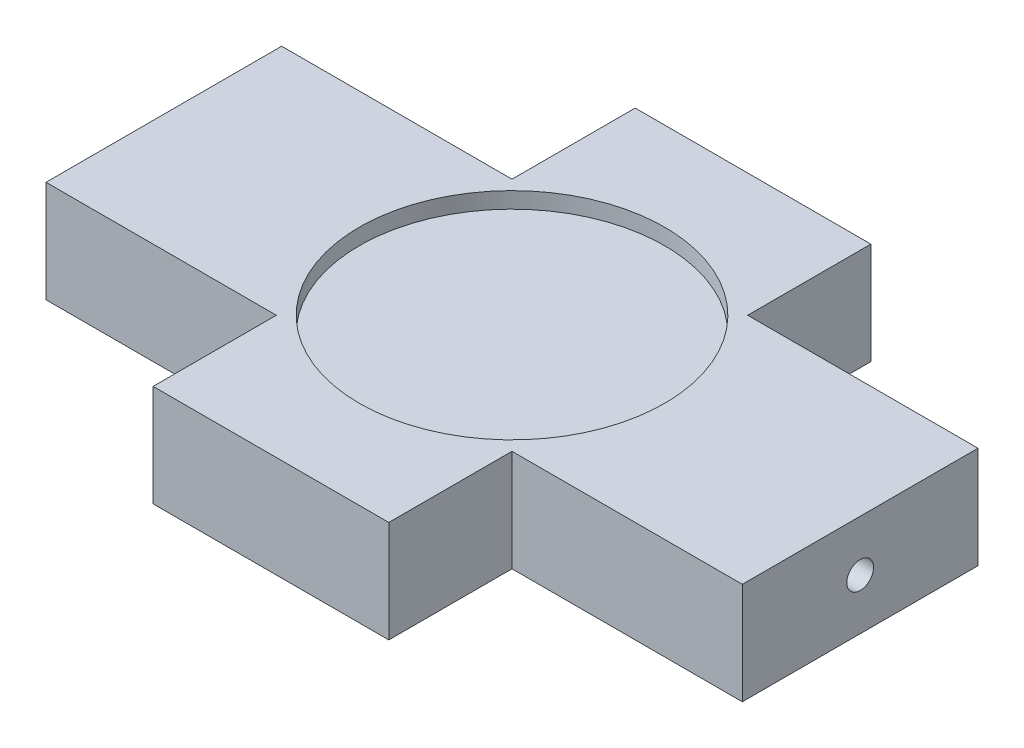
ISO-10303-21;
HEADER;
FILE_DESCRIPTION(('STEP AP214'),'2;1');
FILE_NAME('part.step','',(''),(''),'','','');
FILE_SCHEMA(('AUTOMOTIVE_DESIGN { 1 0 10303 214 1 1 1 1 }'));
ENDSEC;
DATA;
#1=APPLICATION_CONTEXT('core data for automotive mechanical design processes');
#2=APPLICATION_PROTOCOL_DEFINITION('international standard','automotive_design',2000,#1);
#3=PRODUCT_CONTEXT('',#1,'mechanical');
#4=PRODUCT('Part','Part','',(#3));
#5=PRODUCT_RELATED_PRODUCT_CATEGORY('part','',(#4));
#6=PRODUCT_DEFINITION_FORMATION('','',#4);
#7=PRODUCT_DEFINITION_CONTEXT('part definition',#1,'design');
#8=PRODUCT_DEFINITION('design','',#6,#7);
#9=PRODUCT_DEFINITION_SHAPE('','',#8);
#10=(LENGTH_UNIT() NAMED_UNIT(*) SI_UNIT(.MILLI.,.METRE.));
#11=(NAMED_UNIT(*) PLANE_ANGLE_UNIT() SI_UNIT($,.RADIAN.));
#12=(NAMED_UNIT(*) SI_UNIT($,.STERADIAN.) SOLID_ANGLE_UNIT());
#13=UNCERTAINTY_MEASURE_WITH_UNIT(LENGTH_MEASURE(1.E-05),#10,'distance_accuracy_value','');
#14=(GEOMETRIC_REPRESENTATION_CONTEXT(3) GLOBAL_UNCERTAINTY_ASSIGNED_CONTEXT((#13)) GLOBAL_UNIT_ASSIGNED_CONTEXT((#10,
#11,#12)) REPRESENTATION_CONTEXT('',''));
#15=CARTESIAN_POINT('',(0.,0.,0.));
#16=DIRECTION('',(0.,0.,1.));
#17=DIRECTION('',(1.,0.,0.));
#18=AXIS2_PLACEMENT_3D('',#15,#16,#17);
#19=CARTESIAN_POINT('',(0.,19.,0.));
#20=DIRECTION('',(0.,0.,-1.));
#21=DIRECTION('',(-1.,0.,0.));
#22=AXIS2_PLACEMENT_3D('',#19,#20,#21);
#23=PLANE('',#22);
#24=DIRECTION('',(1.,0.,0.));
#25=VECTOR('',#24,1.);
#26=CARTESIAN_POINT('',(0.,0.,0.));
#27=LINE('',#26,#25);
#28=CARTESIAN_POINT('',(23.,0.,0.));
#29=VERTEX_POINT('',#28);
#30=CARTESIAN_POINT('',(67.,0.,0.));
#31=VERTEX_POINT('',#30);
#32=EDGE_CURVE('E221',#29,#31,#27,.T.);
#33=ORIENTED_EDGE('',*,*,#32,.T.);
#34=DIRECTION('',(0.,1.,0.));
#35=VECTOR('',#34,1.);
#36=CARTESIAN_POINT('',(67.,0.,0.));
#37=LINE('',#36,#35);
#38=CARTESIAN_POINT('',(67.,19.,0.));
#39=VERTEX_POINT('',#38);
#40=EDGE_CURVE('E171',#31,#39,#37,.T.);
#41=ORIENTED_EDGE('',*,*,#40,.T.);
#42=DIRECTION('',(1.,0.,0.));
#43=VECTOR('',#42,1.);
#44=CARTESIAN_POINT('',(0.,19.,0.));
#45=LINE('',#44,#43);
#46=CARTESIAN_POINT('',(23.,19.,0.));
#47=VERTEX_POINT('',#46);
#48=EDGE_CURVE('E45',#47,#39,#45,.T.);
#49=ORIENTED_EDGE('',*,*,#48,.F.);
#50=DIRECTION('',(0.,1.,0.));
#51=VECTOR('',#50,1.);
#52=CARTESIAN_POINT('',(23.,0.,0.));
#53=LINE('',#52,#51);
#54=EDGE_CURVE('E187',#29,#47,#53,.T.);
#55=ORIENTED_EDGE('',*,*,#54,.F.);
#56=EDGE_LOOP('',(#33,#41,#49,#55));
#57=FACE_BOUND('',#56,.T.);
#58=ADVANCED_FACE('F36',(#57),#23,.F.);
#59=CARTESIAN_POINT('',(0.,19.,-90.));
#60=DIRECTION('',(0.,0.,1.));
#61=DIRECTION('',(1.,0.,0.));
#62=AXIS2_PLACEMENT_3D('',#59,#60,#61);
#63=PLANE('',#62);
#64=DIRECTION('',(-1.,0.,0.));
#65=VECTOR('',#64,1.);
#66=CARTESIAN_POINT('',(0.,19.,-90.));
#67=LINE('',#66,#65);
#68=CARTESIAN_POINT('',(67.,19.,-90.));
#69=VERTEX_POINT('',#68);
#70=CARTESIAN_POINT('',(23.,19.,-90.));
#71=VERTEX_POINT('',#70);
#72=EDGE_CURVE('E11',#69,#71,#67,.T.);
#73=ORIENTED_EDGE('',*,*,#72,.F.);
#74=DIRECTION('',(0.,1.,0.));
#75=VECTOR('',#74,1.);
#76=CARTESIAN_POINT('',(67.,0.,-90.));
#77=LINE('',#76,#75);
#78=CARTESIAN_POINT('',(67.,0.,-90.));
#79=VERTEX_POINT('',#78);
#80=EDGE_CURVE('E167',#79,#69,#77,.T.);
#81=ORIENTED_EDGE('',*,*,#80,.F.);
#82=DIRECTION('',(-1.,0.,0.));
#83=VECTOR('',#82,1.);
#84=CARTESIAN_POINT('',(0.,0.,-90.));
#85=LINE('',#84,#83);
#86=CARTESIAN_POINT('',(23.,0.,-90.));
#87=VERTEX_POINT('',#86);
#88=EDGE_CURVE('E39',#79,#87,#85,.T.);
#89=ORIENTED_EDGE('',*,*,#88,.T.);
#90=DIRECTION('',(0.,1.,0.));
#91=VECTOR('',#90,1.);
#92=CARTESIAN_POINT('',(23.,0.,-90.));
#93=LINE('',#92,#91);
#94=EDGE_CURVE('E150',#87,#71,#93,.T.);
#95=ORIENTED_EDGE('',*,*,#94,.T.);
#96=EDGE_LOOP('',(#73,#81,#89,#95));
#97=FACE_BOUND('',#96,.T.);
#98=ADVANCED_FACE('F230',(#97),#63,.F.);
#99=CARTESIAN_POINT('',(0.,19.,0.));
#100=DIRECTION('',(0.,-1.,0.));
#101=DIRECTION('',(0.,0.,-1.));
#102=AXIS2_PLACEMENT_3D('',#99,#100,#101);
#103=PLANE('',#102);
#104=CARTESIAN_POINT('',(45.,19.,-45.));
#105=DIRECTION('',(0.,1.,0.));
#106=DIRECTION('',(0.,0.,1.));
#107=AXIS2_PLACEMENT_3D('',#104,#105,#106);
#108=CIRCLE('',#107,28.5);
#109=CARTESIAN_POINT('',(45.,19.,-16.5));
#110=VERTEX_POINT('',#109);
#111=EDGE_CURVE('E193',#110,#110,#108,.T.);
#112=ORIENTED_EDGE('',*,*,#111,.F.);
#113=EDGE_LOOP('',(#112));
#114=FACE_BOUND('',#113,.T.);
#115=ORIENTED_EDGE('',*,*,#48,.T.);
#116=DIRECTION('',(0.,0.,1.));
#117=VECTOR('',#116,1.);
#118=CARTESIAN_POINT('',(67.,19.,0.));
#119=LINE('',#118,#117);
#120=CARTESIAN_POINT('',(67.,19.,-23.));
#121=VERTEX_POINT('',#120);
#122=EDGE_CURVE('E178',#121,#39,#119,.T.);
#123=ORIENTED_EDGE('',*,*,#122,.F.);
#124=DIRECTION('',(-1.,0.,0.));
#125=VECTOR('',#124,1.);
#126=CARTESIAN_POINT('',(110.,19.,-23.));
#127=LINE('',#126,#125);
#128=CARTESIAN_POINT('',(110.,19.,-23.));
#129=VERTEX_POINT('',#128);
#130=EDGE_CURVE('E217',#129,#121,#127,.T.);
#131=ORIENTED_EDGE('',*,*,#130,.F.);
#132=DIRECTION('',(0.,0.,1.));
#133=VECTOR('',#132,1.);
#134=CARTESIAN_POINT('',(110.,19.,-23.));
#135=LINE('',#134,#133);
#136=CARTESIAN_POINT('',(110.,19.,-67.));
#137=VERTEX_POINT('',#136);
#138=EDGE_CURVE('E87',#137,#129,#135,.T.);
#139=ORIENTED_EDGE('',*,*,#138,.F.);
#140=DIRECTION('',(-1.,0.,0.));
#141=VECTOR('',#140,1.);
#142=CARTESIAN_POINT('',(110.,19.,-67.));
#143=LINE('',#142,#141);
#144=CARTESIAN_POINT('',(67.,19.,-67.));
#145=VERTEX_POINT('',#144);
#146=EDGE_CURVE('E219',#137,#145,#143,.T.);
#147=ORIENTED_EDGE('',*,*,#146,.T.);
#148=DIRECTION('',(0.,0.,1.));
#149=VECTOR('',#148,1.);
#150=CARTESIAN_POINT('',(67.,19.,-90.));
#151=LINE('',#150,#149);
#152=EDGE_CURVE('E168',#69,#145,#151,.T.);
#153=ORIENTED_EDGE('',*,*,#152,.F.);
#154=ORIENTED_EDGE('',*,*,#72,.T.);
#155=DIRECTION('',(0.,0.,-1.));
#156=VECTOR('',#155,1.);
#157=CARTESIAN_POINT('',(23.,19.,-90.));
#158=LINE('',#157,#156);
#159=CARTESIAN_POINT('',(23.,19.,-67.));
#160=VERTEX_POINT('',#159);
#161=EDGE_CURVE('E154',#160,#71,#158,.T.);
#162=ORIENTED_EDGE('',*,*,#161,.F.);
#163=CARTESIAN_POINT('',(-20.,19.,-67.));
#164=VERTEX_POINT('',#163);
#165=EDGE_CURVE('E147',#160,#164,#143,.T.);
#166=ORIENTED_EDGE('',*,*,#165,.T.);
#167=DIRECTION('',(0.,0.,1.));
#168=VECTOR('',#167,1.);
#169=CARTESIAN_POINT('',(-20.,19.,-23.));
#170=LINE('',#169,#168);
#171=CARTESIAN_POINT('',(-20.,19.,-23.));
#172=VERTEX_POINT('',#171);
#173=EDGE_CURVE('E208',#164,#172,#170,.T.);
#174=ORIENTED_EDGE('',*,*,#173,.T.);
#175=CARTESIAN_POINT('',(23.,19.,-23.));
#176=VERTEX_POINT('',#175);
#177=EDGE_CURVE('E216',#176,#172,#127,.T.);
#178=ORIENTED_EDGE('',*,*,#177,.F.);
#179=DIRECTION('',(0.,0.,-1.));
#180=VECTOR('',#179,1.);
#181=CARTESIAN_POINT('',(23.,19.,0.));
#182=LINE('',#181,#180);
#183=EDGE_CURVE('E162',#47,#176,#182,.T.);
#184=ORIENTED_EDGE('',*,*,#183,.F.);
#185=EDGE_LOOP('',(#115,#123,#131,#139,#147,#153,#154,#162,#166,#174,#178,#184));
#186=FACE_BOUND('',#185,.T.);
#187=ADVANCED_FACE('F243',(#114,#186),#103,.F.);
#188=CARTESIAN_POINT('',(0.,0.,0.));
#189=DIRECTION('',(0.,-1.,0.));
#190=DIRECTION('',(0.,0.,-1.));
#191=AXIS2_PLACEMENT_3D('',#188,#189,#190);
#192=PLANE('',#191);
#193=DIRECTION('',(0.,0.,1.));
#194=VECTOR('',#193,1.);
#195=CARTESIAN_POINT('',(67.,0.,0.));
#196=LINE('',#195,#194);
#197=CARTESIAN_POINT('',(67.,0.,-23.));
#198=VERTEX_POINT('',#197);
#199=EDGE_CURVE('E175',#198,#31,#196,.T.);
#200=ORIENTED_EDGE('',*,*,#199,.T.);
#201=ORIENTED_EDGE('',*,*,#32,.F.);
#202=DIRECTION('',(0.,0.,-1.));
#203=VECTOR('',#202,1.);
#204=CARTESIAN_POINT('',(23.,0.,0.));
#205=LINE('',#204,#203);
#206=CARTESIAN_POINT('',(23.,0.,-23.));
#207=VERTEX_POINT('',#206);
#208=EDGE_CURVE('E185',#29,#207,#205,.T.);
#209=ORIENTED_EDGE('',*,*,#208,.T.);
#210=DIRECTION('',(-1.,0.,0.));
#211=VECTOR('',#210,1.);
#212=CARTESIAN_POINT('',(110.,0.,-23.));
#213=LINE('',#212,#211);
#214=CARTESIAN_POINT('',(-20.,0.,-23.));
#215=VERTEX_POINT('',#214);
#216=EDGE_CURVE('E72',#207,#215,#213,.T.);
#217=ORIENTED_EDGE('',*,*,#216,.T.);
#218=DIRECTION('',(0.,0.,-1.));
#219=VECTOR('',#218,1.);
#220=CARTESIAN_POINT('',(-20.,0.,-23.));
#221=LINE('',#220,#219);
#222=CARTESIAN_POINT('',(-20.,0.,-67.));
#223=VERTEX_POINT('',#222);
#224=EDGE_CURVE('E140',#215,#223,#221,.T.);
#225=ORIENTED_EDGE('',*,*,#224,.T.);
#226=DIRECTION('',(-1.,0.,0.));
#227=VECTOR('',#226,1.);
#228=CARTESIAN_POINT('',(110.,0.,-67.));
#229=LINE('',#228,#227);
#230=CARTESIAN_POINT('',(23.,0.,-67.));
#231=VERTEX_POINT('',#230);
#232=EDGE_CURVE('E80',#231,#223,#229,.T.);
#233=ORIENTED_EDGE('',*,*,#232,.F.);
#234=DIRECTION('',(0.,0.,-1.));
#235=VECTOR('',#234,1.);
#236=CARTESIAN_POINT('',(23.,0.,-90.));
#237=LINE('',#236,#235);
#238=EDGE_CURVE('E137',#231,#87,#237,.T.);
#239=ORIENTED_EDGE('',*,*,#238,.T.);
#240=ORIENTED_EDGE('',*,*,#88,.F.);
#241=DIRECTION('',(0.,0.,1.));
#242=VECTOR('',#241,1.);
#243=CARTESIAN_POINT('',(67.,0.,-90.));
#244=LINE('',#243,#242);
#245=CARTESIAN_POINT('',(67.,0.,-67.));
#246=VERTEX_POINT('',#245);
#247=EDGE_CURVE('E164',#79,#246,#244,.T.);
#248=ORIENTED_EDGE('',*,*,#247,.T.);
#249=CARTESIAN_POINT('',(110.,0.,-67.));
#250=VERTEX_POINT('',#249);
#251=EDGE_CURVE('E142',#250,#246,#229,.T.);
#252=ORIENTED_EDGE('',*,*,#251,.F.);
#253=DIRECTION('',(0.,0.,-1.));
#254=VECTOR('',#253,1.);
#255=CARTESIAN_POINT('',(110.,0.,-23.));
#256=LINE('',#255,#254);
#257=CARTESIAN_POINT('',(110.,0.,-23.));
#258=VERTEX_POINT('',#257);
#259=EDGE_CURVE('E54',#258,#250,#256,.T.);
#260=ORIENTED_EDGE('',*,*,#259,.F.);
#261=EDGE_CURVE('E214',#258,#198,#213,.T.);
#262=ORIENTED_EDGE('',*,*,#261,.T.);
#263=EDGE_LOOP('',(#200,#201,#209,#217,#225,#233,#239,#240,#248,#252,#260,#262));
#264=FACE_BOUND('',#263,.T.);
#265=ADVANCED_FACE('F134',(#264),#192,.T.);
#266=CARTESIAN_POINT('',(110.,0.,0.));
#267=DIRECTION('',(1.,0.,0.));
#268=DIRECTION('',(0.,0.,-1.));
#269=AXIS2_PLACEMENT_3D('',#266,#267,#268);
#270=PLANE('',#269);
#271=CARTESIAN_POINT('',(110.,9.5,-45.));
#272=DIRECTION('',(1.,0.,0.));
#273=DIRECTION('',(0.,0.,-1.));
#274=AXIS2_PLACEMENT_3D('',#271,#272,#273);
#275=CIRCLE('',#274,2.5);
#276=CARTESIAN_POINT('',(110.,9.5,-47.5));
#277=VERTEX_POINT('',#276);
#278=EDGE_CURVE('E159',#277,#277,#275,.T.);
#279=ORIENTED_EDGE('',*,*,#278,.F.);
#280=EDGE_LOOP('',(#279));
#281=FACE_BOUND('',#280,.T.);
#282=DIRECTION('',(0.,1.,0.));
#283=VECTOR('',#282,1.);
#284=CARTESIAN_POINT('',(110.,19.,-67.));
#285=LINE('',#284,#283);
#286=EDGE_CURVE('E201',#250,#137,#285,.T.);
#287=ORIENTED_EDGE('',*,*,#286,.T.);
#288=ORIENTED_EDGE('',*,*,#138,.T.);
#289=DIRECTION('',(0.,-1.,0.));
#290=VECTOR('',#289,1.);
#291=CARTESIAN_POINT('',(110.,19.,-23.));
#292=LINE('',#291,#290);
#293=EDGE_CURVE('E204',#129,#258,#292,.T.);
#294=ORIENTED_EDGE('',*,*,#293,.T.);
#295=ORIENTED_EDGE('',*,*,#259,.T.);
#296=EDGE_LOOP('',(#287,#288,#294,#295));
#297=FACE_BOUND('',#296,.T.);
#298=ADVANCED_FACE('F239',(#281,#297),#270,.T.);
#299=CARTESIAN_POINT('',(110.,19.,-23.));
#300=DIRECTION('',(0.,0.,-1.));
#301=DIRECTION('',(0.,1.,0.));
#302=AXIS2_PLACEMENT_3D('',#299,#300,#301);
#303=PLANE('',#302);
#304=ORIENTED_EDGE('',*,*,#130,.T.);
#305=DIRECTION('',(0.,1.,0.));
#306=VECTOR('',#305,1.);
#307=CARTESIAN_POINT('',(67.,0.,-23.));
#308=LINE('',#307,#306);
#309=EDGE_CURVE('E177',#198,#121,#308,.T.);
#310=ORIENTED_EDGE('',*,*,#309,.F.);
#311=ORIENTED_EDGE('',*,*,#261,.F.);
#312=ORIENTED_EDGE('',*,*,#293,.F.);
#313=EDGE_LOOP('',(#304,#310,#311,#312));
#314=FACE_BOUND('',#313,.T.);
#315=ADVANCED_FACE('F246',(#314),#303,.F.);
#316=CARTESIAN_POINT('',(110.,19.,-67.));
#317=DIRECTION('',(0.,0.,1.));
#318=DIRECTION('',(1.,0.,0.));
#319=AXIS2_PLACEMENT_3D('',#316,#317,#318);
#320=PLANE('',#319);
#321=ORIENTED_EDGE('',*,*,#251,.T.);
#322=DIRECTION('',(0.,1.,0.));
#323=VECTOR('',#322,1.);
#324=CARTESIAN_POINT('',(67.,0.,-67.));
#325=LINE('',#324,#323);
#326=EDGE_CURVE('E156',#246,#145,#325,.T.);
#327=ORIENTED_EDGE('',*,*,#326,.T.);
#328=ORIENTED_EDGE('',*,*,#146,.F.);
#329=ORIENTED_EDGE('',*,*,#286,.F.);
#330=EDGE_LOOP('',(#321,#327,#328,#329));
#331=FACE_BOUND('',#330,.T.);
#332=ADVANCED_FACE('F238',(#331),#320,.F.);
#333=ORIENTED_EDGE('',*,*,#165,.F.);
#334=DIRECTION('',(0.,1.,0.));
#335=VECTOR('',#334,1.);
#336=CARTESIAN_POINT('',(23.,0.,-67.));
#337=LINE('',#336,#335);
#338=EDGE_CURVE('E145',#231,#160,#337,.T.);
#339=ORIENTED_EDGE('',*,*,#338,.F.);
#340=ORIENTED_EDGE('',*,*,#232,.T.);
#341=DIRECTION('',(0.,1.,0.));
#342=VECTOR('',#341,1.);
#343=CARTESIAN_POINT('',(-20.,19.,-67.));
#344=LINE('',#343,#342);
#345=EDGE_CURVE('E198',#223,#164,#344,.T.);
#346=ORIENTED_EDGE('',*,*,#345,.T.);
#347=EDGE_LOOP('',(#333,#339,#340,#346));
#348=FACE_BOUND('',#347,.T.);
#349=ADVANCED_FACE('F146',(#348),#320,.F.);
#350=ORIENTED_EDGE('',*,*,#216,.F.);
#351=DIRECTION('',(0.,1.,0.));
#352=VECTOR('',#351,1.);
#353=CARTESIAN_POINT('',(23.,0.,-23.));
#354=LINE('',#353,#352);
#355=EDGE_CURVE('E190',#207,#176,#354,.T.);
#356=ORIENTED_EDGE('',*,*,#355,.T.);
#357=ORIENTED_EDGE('',*,*,#177,.T.);
#358=DIRECTION('',(0.,-1.,0.));
#359=VECTOR('',#358,1.);
#360=CARTESIAN_POINT('',(-20.,19.,-23.));
#361=LINE('',#360,#359);
#362=EDGE_CURVE('E211',#172,#215,#361,.T.);
#363=ORIENTED_EDGE('',*,*,#362,.T.);
#364=EDGE_LOOP('',(#350,#356,#357,#363));
#365=FACE_BOUND('',#364,.T.);
#366=ADVANCED_FACE('F256',(#365),#303,.F.);
#367=CARTESIAN_POINT('',(-20.,0.,0.));
#368=DIRECTION('',(1.,0.,0.));
#369=DIRECTION('',(0.,0.,-1.));
#370=AXIS2_PLACEMENT_3D('',#367,#368,#369);
#371=PLANE('',#370);
#372=CARTESIAN_POINT('',(-20.,9.5,-45.));
#373=DIRECTION('',(-1.,0.,0.));
#374=DIRECTION('',(0.,0.,1.));
#375=AXIS2_PLACEMENT_3D('',#372,#373,#374);
#376=CIRCLE('',#375,2.5);
#377=CARTESIAN_POINT('',(-20.,9.5,-42.5));
#378=VERTEX_POINT('',#377);
#379=EDGE_CURVE('E333',#378,#378,#376,.T.);
#380=ORIENTED_EDGE('',*,*,#379,.F.);
#381=EDGE_LOOP('',(#380));
#382=FACE_BOUND('',#381,.T.);
#383=ORIENTED_EDGE('',*,*,#345,.F.);
#384=ORIENTED_EDGE('',*,*,#224,.F.);
#385=ORIENTED_EDGE('',*,*,#362,.F.);
#386=ORIENTED_EDGE('',*,*,#173,.F.);
#387=EDGE_LOOP('',(#383,#384,#385,#386));
#388=FACE_BOUND('',#387,.T.);
#389=ADVANCED_FACE('F260',(#382,#388),#371,.F.);
#390=CARTESIAN_POINT('',(45.,16.,-45.));
#391=DIRECTION('',(0.,1.,0.));
#392=DIRECTION('',(0.,0.,1.));
#393=AXIS2_PLACEMENT_3D('',#390,#391,#392);
#394=CYLINDRICAL_SURFACE('',#393,28.5);
#395=CARTESIAN_POINT('',(45.,16.,-45.));
#396=DIRECTION('',(0.,1.,0.));
#397=DIRECTION('',(0.,0.,1.));
#398=AXIS2_PLACEMENT_3D('',#395,#396,#397);
#399=CIRCLE('',#398,28.5);
#400=CARTESIAN_POINT('',(45.,16.,-16.5));
#401=VERTEX_POINT('',#400);
#402=EDGE_CURVE('E195',#401,#401,#399,.T.);
#403=ORIENTED_EDGE('',*,*,#402,.F.);
#404=EDGE_LOOP('',(#403));
#405=FACE_BOUND('',#404,.T.);
#406=ORIENTED_EDGE('',*,*,#111,.T.);
#407=EDGE_LOOP('',(#406));
#408=FACE_BOUND('',#407,.T.);
#409=ADVANCED_FACE('F262',(#405,#408),#394,.F.);
#410=CARTESIAN_POINT('',(45.,16.,-45.));
#411=DIRECTION('',(0.,1.,0.));
#412=DIRECTION('',(0.,0.,1.));
#413=AXIS2_PLACEMENT_3D('',#410,#411,#412);
#414=PLANE('',#413);
#415=ORIENTED_EDGE('',*,*,#402,.T.);
#416=EDGE_LOOP('',(#415));
#417=FACE_BOUND('',#416,.T.);
#418=ADVANCED_FACE('F269',(#417),#414,.T.);
#419=CARTESIAN_POINT('',(23.,0.,0.));
#420=DIRECTION('',(1.,0.,0.));
#421=DIRECTION('',(0.,0.,-1.));
#422=AXIS2_PLACEMENT_3D('',#419,#420,#421);
#423=PLANE('',#422);
#424=ORIENTED_EDGE('',*,*,#183,.T.);
#425=ORIENTED_EDGE('',*,*,#355,.F.);
#426=ORIENTED_EDGE('',*,*,#208,.F.);
#427=ORIENTED_EDGE('',*,*,#54,.T.);
#428=EDGE_LOOP('',(#424,#425,#426,#427));
#429=FACE_BOUND('',#428,.T.);
#430=ADVANCED_FACE('F254',(#429),#423,.F.);
#431=CARTESIAN_POINT('',(23.,0.,-90.));
#432=DIRECTION('',(1.,0.,0.));
#433=DIRECTION('',(0.,0.,-1.));
#434=AXIS2_PLACEMENT_3D('',#431,#432,#433);
#435=PLANE('',#434);
#436=ORIENTED_EDGE('',*,*,#161,.T.);
#437=ORIENTED_EDGE('',*,*,#94,.F.);
#438=ORIENTED_EDGE('',*,*,#238,.F.);
#439=ORIENTED_EDGE('',*,*,#338,.T.);
#440=EDGE_LOOP('',(#436,#437,#438,#439));
#441=FACE_BOUND('',#440,.T.);
#442=ADVANCED_FACE('F152',(#441),#435,.F.);
#443=CARTESIAN_POINT('',(67.,0.,-90.));
#444=DIRECTION('',(-1.,0.,0.));
#445=DIRECTION('',(0.,0.,1.));
#446=AXIS2_PLACEMENT_3D('',#443,#444,#445);
#447=PLANE('',#446);
#448=ORIENTED_EDGE('',*,*,#152,.T.);
#449=ORIENTED_EDGE('',*,*,#326,.F.);
#450=ORIENTED_EDGE('',*,*,#247,.F.);
#451=ORIENTED_EDGE('',*,*,#80,.T.);
#452=EDGE_LOOP('',(#448,#449,#450,#451));
#453=FACE_BOUND('',#452,.T.);
#454=ADVANCED_FACE('F234',(#453),#447,.F.);
#455=CARTESIAN_POINT('',(67.,0.,0.));
#456=DIRECTION('',(-1.,0.,0.));
#457=DIRECTION('',(0.,0.,1.));
#458=AXIS2_PLACEMENT_3D('',#455,#456,#457);
#459=PLANE('',#458);
#460=ORIENTED_EDGE('',*,*,#122,.T.);
#461=ORIENTED_EDGE('',*,*,#40,.F.);
#462=ORIENTED_EDGE('',*,*,#199,.F.);
#463=ORIENTED_EDGE('',*,*,#309,.T.);
#464=EDGE_LOOP('',(#460,#461,#462,#463));
#465=FACE_BOUND('',#464,.T.);
#466=ADVANCED_FACE('F249',(#465),#459,.F.);
#467=CARTESIAN_POINT('',(100.,9.5,-45.));
#468=DIRECTION('',(1.,0.,0.));
#469=DIRECTION('',(0.,0.,-1.));
#470=AXIS2_PLACEMENT_3D('',#467,#468,#469);
#471=CYLINDRICAL_SURFACE('',#470,2.5);
#472=CARTESIAN_POINT('',(100.,9.5,-45.));
#473=DIRECTION('',(1.,0.,0.));
#474=DIRECTION('',(0.,0.,-1.));
#475=AXIS2_PLACEMENT_3D('',#472,#473,#474);
#476=CIRCLE('',#475,2.5);
#477=CARTESIAN_POINT('',(100.,9.5,-47.5));
#478=VERTEX_POINT('',#477);
#479=EDGE_CURVE('E180',#478,#478,#476,.T.);
#480=ORIENTED_EDGE('',*,*,#479,.F.);
#481=EDGE_LOOP('',(#480));
#482=FACE_BOUND('',#481,.T.);
#483=ORIENTED_EDGE('',*,*,#278,.T.);
#484=EDGE_LOOP('',(#483));
#485=FACE_BOUND('',#484,.T.);
#486=ADVANCED_FACE('F309',(#482,#485),#471,.F.);
#487=CARTESIAN_POINT('',(100.,9.5,-45.));
#488=DIRECTION('',(1.,0.,0.));
#489=DIRECTION('',(0.,0.,-1.));
#490=AXIS2_PLACEMENT_3D('',#487,#488,#489);
#491=PLANE('',#490);
#492=ORIENTED_EDGE('',*,*,#479,.T.);
#493=EDGE_LOOP('',(#492));
#494=FACE_BOUND('',#493,.T.);
#495=ADVANCED_FACE('F316',(#494),#491,.T.);
#496=CARTESIAN_POINT('',(-10.,9.5,-45.));
#497=DIRECTION('',(-1.,0.,0.));
#498=DIRECTION('',(0.,0.,1.));
#499=AXIS2_PLACEMENT_3D('',#496,#497,#498);
#500=CYLINDRICAL_SURFACE('',#499,2.5);
#501=CARTESIAN_POINT('',(-10.,9.5,-45.));
#502=DIRECTION('',(-1.,0.,0.));
#503=DIRECTION('',(0.,0.,1.));
#504=AXIS2_PLACEMENT_3D('',#501,#502,#503);
#505=CIRCLE('',#504,2.5);
#506=CARTESIAN_POINT('',(-10.,9.5,-42.5));
#507=VERTEX_POINT('',#506);
#508=EDGE_CURVE('E332',#507,#507,#505,.T.);
#509=ORIENTED_EDGE('',*,*,#508,.F.);
#510=EDGE_LOOP('',(#509));
#511=FACE_BOUND('',#510,.T.);
#512=ORIENTED_EDGE('',*,*,#379,.T.);
#513=EDGE_LOOP('',(#512));
#514=FACE_BOUND('',#513,.T.);
#515=ADVANCED_FACE('F320',(#511,#514),#500,.F.);
#516=CARTESIAN_POINT('',(-10.,9.5,-45.));
#517=DIRECTION('',(-1.,0.,0.));
#518=DIRECTION('',(0.,0.,1.));
#519=AXIS2_PLACEMENT_3D('',#516,#517,#518);
#520=PLANE('',#519);
#521=ORIENTED_EDGE('',*,*,#508,.T.);
#522=EDGE_LOOP('',(#521));
#523=FACE_BOUND('',#522,.T.);
#524=ADVANCED_FACE('F324',(#523),#520,.T.);
#525=CLOSED_SHELL('',(#58,#98,#187,#265,#298,#315,#332,#349,#366,#389,#409,#418,#430,#442,#454,
#466,#486,#495,#515,#524));
#526=MANIFOLD_SOLID_BREP('B2',#525);
#527=ADVANCED_BREP_SHAPE_REPRESENTATION('',(#18,#526),#14);
#528=SHAPE_DEFINITION_REPRESENTATION(#9,#527);
ENDSEC;
END-ISO-10303-21;
